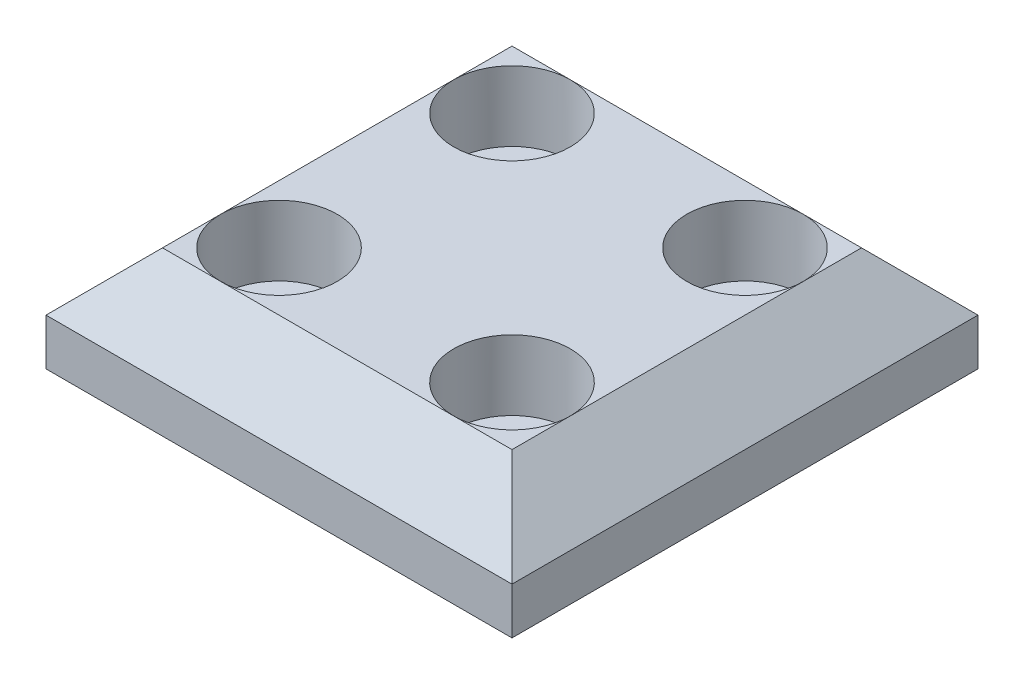
ISO-10303-21;
HEADER;
FILE_DESCRIPTION(('STEP AP214'),'2;1');
FILE_NAME('part.step','',(''),(''),'','','');
FILE_SCHEMA(('AUTOMOTIVE_DESIGN { 1 0 10303 214 1 1 1 1 }'));
ENDSEC;
DATA;
#1=APPLICATION_CONTEXT('core data for automotive mechanical design processes');
#2=APPLICATION_PROTOCOL_DEFINITION('international standard','automotive_design',2000,#1);
#3=PRODUCT_CONTEXT('',#1,'mechanical');
#4=PRODUCT('Part','Part','',(#3));
#5=PRODUCT_RELATED_PRODUCT_CATEGORY('part','',(#4));
#6=PRODUCT_DEFINITION_FORMATION('','',#4);
#7=PRODUCT_DEFINITION_CONTEXT('part definition',#1,'design');
#8=PRODUCT_DEFINITION('design','',#6,#7);
#9=PRODUCT_DEFINITION_SHAPE('','',#8);
#10=(LENGTH_UNIT() NAMED_UNIT(*) SI_UNIT(.MILLI.,.METRE.));
#11=(NAMED_UNIT(*) PLANE_ANGLE_UNIT() SI_UNIT($,.RADIAN.));
#12=(NAMED_UNIT(*) SI_UNIT($,.STERADIAN.) SOLID_ANGLE_UNIT());
#13=UNCERTAINTY_MEASURE_WITH_UNIT(LENGTH_MEASURE(1.E-05),#10,'distance_accuracy_value','');
#14=(GEOMETRIC_REPRESENTATION_CONTEXT(3) GLOBAL_UNCERTAINTY_ASSIGNED_CONTEXT((#13)) GLOBAL_UNIT_ASSIGNED_CONTEXT((#10,
#11,#12)) REPRESENTATION_CONTEXT('',''));
#15=CARTESIAN_POINT('',(0.,0.,0.));
#16=DIRECTION('',(0.,0.,1.));
#17=DIRECTION('',(1.,0.,0.));
#18=AXIS2_PLACEMENT_3D('',#15,#16,#17);
#19=CARTESIAN_POINT('',(0.,9.,0.));
#20=DIRECTION('',(0.,-1.,0.));
#21=DIRECTION('',(0.,0.,-1.));
#22=AXIS2_PLACEMENT_3D('',#19,#20,#21);
#23=PLANE('',#22);
#24=CARTESIAN_POINT('',(30.,9.,-10.));
#25=DIRECTION('',(0.,1.,0.));
#26=DIRECTION('',(0.,0.,1.));
#27=AXIS2_PLACEMENT_3D('',#24,#25,#26);
#28=CIRCLE('',#27,5.);
#29=CARTESIAN_POINT('',(30.,9.,-5.00000000000001));
#30=VERTEX_POINT('',#29);
#31=CARTESIAN_POINT('',(35.,9.,-10.));
#32=VERTEX_POINT('',#31);
#33=EDGE_CURVE('E268',#30,#32,#28,.T.);
#34=ORIENTED_EDGE('',*,*,#33,.F.);
#35=DIRECTION('',(1.,0.,0.));
#36=VECTOR('',#35,1.);
#37=CARTESIAN_POINT('',(0.,9.,-5.00000000000001));
#38=LINE('',#37,#36);
#39=CARTESIAN_POINT('',(35.,9.,-5.00000000000001));
#40=VERTEX_POINT('',#39);
#41=EDGE_CURVE('E194',#30,#40,#38,.T.);
#42=ORIENTED_EDGE('',*,*,#41,.T.);
#43=DIRECTION('',(0.,0.,-1.));
#44=VECTOR('',#43,1.);
#45=CARTESIAN_POINT('',(35.,9.,0.));
#46=LINE('',#45,#44);
#47=EDGE_CURVE('E192',#40,#32,#46,.T.);
#48=ORIENTED_EDGE('',*,*,#47,.T.);
#49=EDGE_LOOP('',(#34,#42,#48));
#50=FACE_BOUND('',#49,.T.);
#51=ADVANCED_FACE('F43',(#50),#23,.F.);
#52=EDGE_CURVE('E267',#32,#30,#28,.T.);
#53=ORIENTED_EDGE('',*,*,#52,.F.);
#54=DIRECTION('',(0.,0.,-1.));
#55=VECTOR('',#54,1.);
#56=CARTESIAN_POINT('',(35.,9.,0.));
#57=LINE('',#56,#55);
#58=CARTESIAN_POINT('',(35.,9.,-30.));
#59=VERTEX_POINT('',#58);
#60=EDGE_CURVE('E190',#32,#59,#57,.T.);
#61=ORIENTED_EDGE('',*,*,#60,.T.);
#62=CARTESIAN_POINT('',(30.,9.,-30.));
#63=DIRECTION('',(0.,1.,0.));
#64=DIRECTION('',(0.,0.,1.));
#65=AXIS2_PLACEMENT_3D('',#62,#63,#64);
#66=CIRCLE('',#65,5.);
#67=CARTESIAN_POINT('',(30.,9.,-35.));
#68=VERTEX_POINT('',#67);
#69=EDGE_CURVE('E257',#68,#59,#66,.T.);
#70=ORIENTED_EDGE('',*,*,#69,.F.);
#71=DIRECTION('',(-1.,0.,0.));
#72=VECTOR('',#71,1.);
#73=CARTESIAN_POINT('',(0.,9.,-35.));
#74=LINE('',#73,#72);
#75=CARTESIAN_POINT('',(10.,9.,-35.));
#76=VERTEX_POINT('',#75);
#77=EDGE_CURVE('E181',#68,#76,#74,.T.);
#78=ORIENTED_EDGE('',*,*,#77,.T.);
#79=CARTESIAN_POINT('',(10.,9.,-30.));
#80=DIRECTION('',(0.,1.,0.));
#81=DIRECTION('',(0.,0.,1.));
#82=AXIS2_PLACEMENT_3D('',#79,#80,#81);
#83=CIRCLE('',#82,5.);
#84=CARTESIAN_POINT('',(5.00000000000001,9.,-30.));
#85=VERTEX_POINT('',#84);
#86=EDGE_CURVE('E216',#85,#76,#83,.T.);
#87=ORIENTED_EDGE('',*,*,#86,.F.);
#88=DIRECTION('',(0.,0.,1.));
#89=VECTOR('',#88,1.);
#90=CARTESIAN_POINT('',(5.00000000000001,9.,0.));
#91=LINE('',#90,#89);
#92=CARTESIAN_POINT('',(5.00000000000001,9.,-10.));
#93=VERTEX_POINT('',#92);
#94=EDGE_CURVE('E173',#85,#93,#91,.T.);
#95=ORIENTED_EDGE('',*,*,#94,.T.);
#96=CARTESIAN_POINT('',(10.,9.,-10.));
#97=DIRECTION('',(0.,1.,0.));
#98=DIRECTION('',(0.,0.,1.));
#99=AXIS2_PLACEMENT_3D('',#96,#97,#98);
#100=CIRCLE('',#99,5.);
#101=CARTESIAN_POINT('',(10.,9.,-5.00000000000001));
#102=VERTEX_POINT('',#101);
#103=EDGE_CURVE('E227',#102,#93,#100,.T.);
#104=ORIENTED_EDGE('',*,*,#103,.F.);
#105=DIRECTION('',(1.,0.,0.));
#106=VECTOR('',#105,1.);
#107=CARTESIAN_POINT('',(0.,9.,-5.00000000000001));
#108=LINE('',#107,#106);
#109=EDGE_CURVE('E186',#102,#30,#108,.T.);
#110=ORIENTED_EDGE('',*,*,#109,.T.);
#111=EDGE_LOOP('',(#53,#61,#70,#78,#87,#95,#104,#110));
#112=FACE_BOUND('',#111,.T.);
#113=ADVANCED_FACE('F287',(#112),#23,.F.);
#114=EDGE_CURVE('E259',#59,#68,#66,.T.);
#115=ORIENTED_EDGE('',*,*,#114,.F.);
#116=DIRECTION('',(0.,0.,-1.));
#117=VECTOR('',#116,1.);
#118=CARTESIAN_POINT('',(35.,9.,0.));
#119=LINE('',#118,#117);
#120=CARTESIAN_POINT('',(35.,9.,-35.));
#121=VERTEX_POINT('',#120);
#122=EDGE_CURVE('E188',#59,#121,#119,.T.);
#123=ORIENTED_EDGE('',*,*,#122,.T.);
#124=DIRECTION('',(-1.,0.,0.));
#125=VECTOR('',#124,1.);
#126=CARTESIAN_POINT('',(0.,9.,-35.));
#127=LINE('',#126,#125);
#128=EDGE_CURVE('E183',#121,#68,#127,.T.);
#129=ORIENTED_EDGE('',*,*,#128,.T.);
#130=EDGE_LOOP('',(#115,#123,#129));
#131=FACE_BOUND('',#130,.T.);
#132=ADVANCED_FACE('F291',(#131),#23,.F.);
#133=EDGE_CURVE('E221',#76,#85,#83,.T.);
#134=ORIENTED_EDGE('',*,*,#133,.F.);
#135=DIRECTION('',(-1.,0.,0.));
#136=VECTOR('',#135,1.);
#137=CARTESIAN_POINT('',(0.,9.,-35.));
#138=LINE('',#137,#136);
#139=CARTESIAN_POINT('',(5.00000000000001,9.,-35.));
#140=VERTEX_POINT('',#139);
#141=EDGE_CURVE('E179',#76,#140,#138,.T.);
#142=ORIENTED_EDGE('',*,*,#141,.T.);
#143=DIRECTION('',(0.,0.,1.));
#144=VECTOR('',#143,1.);
#145=CARTESIAN_POINT('',(5.00000000000001,9.,0.));
#146=LINE('',#145,#144);
#147=EDGE_CURVE('E175',#140,#85,#146,.T.);
#148=ORIENTED_EDGE('',*,*,#147,.T.);
#149=EDGE_LOOP('',(#134,#142,#148));
#150=FACE_BOUND('',#149,.T.);
#151=ADVANCED_FACE('F302',(#150),#23,.F.);
#152=CARTESIAN_POINT('',(10.,9.,-30.));
#153=DIRECTION('',(0.,-1.,0.));
#154=DIRECTION('',(0.,0.,-1.));
#155=AXIS2_PLACEMENT_3D('',#152,#153,#154);
#156=CYLINDRICAL_SURFACE('',#155,2.75);
#157=CARTESIAN_POINT('',(10.,0.,-30.));
#158=DIRECTION('',(0.,1.,0.));
#159=DIRECTION('',(0.,0.,1.));
#160=AXIS2_PLACEMENT_3D('',#157,#158,#159);
#161=CIRCLE('',#160,2.75);
#162=CARTESIAN_POINT('',(10.,0.,-27.25));
#163=VERTEX_POINT('',#162);
#164=EDGE_CURVE('E144',#163,#163,#161,.T.);
#165=ORIENTED_EDGE('',*,*,#164,.F.);
#166=EDGE_LOOP('',(#165));
#167=FACE_BOUND('',#166,.T.);
#168=CARTESIAN_POINT('',(10.,3.,-30.));
#169=DIRECTION('',(0.,1.,0.));
#170=DIRECTION('',(0.,0.,1.));
#171=AXIS2_PLACEMENT_3D('',#168,#169,#170);
#172=CIRCLE('',#171,2.75);
#173=CARTESIAN_POINT('',(10.,3.,-27.25));
#174=VERTEX_POINT('',#173);
#175=EDGE_CURVE('E168',#174,#174,#172,.T.);
#176=ORIENTED_EDGE('',*,*,#175,.T.);
#177=EDGE_LOOP('',(#176));
#178=FACE_BOUND('',#177,.T.);
#179=ADVANCED_FACE('F243',(#167,#178),#156,.F.);
#180=CARTESIAN_POINT('',(30.,9.,-30.));
#181=DIRECTION('',(0.,-1.,0.));
#182=DIRECTION('',(0.,0.,-1.));
#183=AXIS2_PLACEMENT_3D('',#180,#181,#182);
#184=CYLINDRICAL_SURFACE('',#183,2.75);
#185=CARTESIAN_POINT('',(30.,0.,-30.));
#186=DIRECTION('',(0.,1.,0.));
#187=DIRECTION('',(0.,0.,1.));
#188=AXIS2_PLACEMENT_3D('',#185,#186,#187);
#189=CIRCLE('',#188,2.75);
#190=CARTESIAN_POINT('',(30.,0.,-27.25));
#191=VERTEX_POINT('',#190);
#192=EDGE_CURVE('E147',#191,#191,#189,.T.);
#193=ORIENTED_EDGE('',*,*,#192,.F.);
#194=EDGE_LOOP('',(#193));
#195=FACE_BOUND('',#194,.T.);
#196=CARTESIAN_POINT('',(30.,3.,-30.));
#197=DIRECTION('',(0.,1.,0.));
#198=DIRECTION('',(0.,0.,1.));
#199=AXIS2_PLACEMENT_3D('',#196,#197,#198);
#200=CIRCLE('',#199,2.75);
#201=CARTESIAN_POINT('',(30.,3.,-27.25));
#202=VERTEX_POINT('',#201);
#203=EDGE_CURVE('E165',#202,#202,#200,.T.);
#204=ORIENTED_EDGE('',*,*,#203,.T.);
#205=EDGE_LOOP('',(#204));
#206=FACE_BOUND('',#205,.T.);
#207=ADVANCED_FACE('F239',(#195,#206),#184,.F.);
#208=CARTESIAN_POINT('',(30.,9.,-10.));
#209=DIRECTION('',(0.,-1.,0.));
#210=DIRECTION('',(0.,0.,-1.));
#211=AXIS2_PLACEMENT_3D('',#208,#209,#210);
#212=CYLINDRICAL_SURFACE('',#211,2.75);
#213=CARTESIAN_POINT('',(30.,0.,-10.));
#214=DIRECTION('',(0.,1.,0.));
#215=DIRECTION('',(0.,0.,1.));
#216=AXIS2_PLACEMENT_3D('',#213,#214,#215);
#217=CIRCLE('',#216,2.75);
#218=CARTESIAN_POINT('',(30.,0.,-7.25));
#219=VERTEX_POINT('',#218);
#220=EDGE_CURVE('E233',#219,#219,#217,.T.);
#221=ORIENTED_EDGE('',*,*,#220,.F.);
#222=EDGE_LOOP('',(#221));
#223=FACE_BOUND('',#222,.T.);
#224=CARTESIAN_POINT('',(30.,3.,-10.));
#225=DIRECTION('',(0.,1.,0.));
#226=DIRECTION('',(0.,0.,1.));
#227=AXIS2_PLACEMENT_3D('',#224,#225,#226);
#228=CIRCLE('',#227,2.75);
#229=CARTESIAN_POINT('',(30.,3.,-7.25));
#230=VERTEX_POINT('',#229);
#231=EDGE_CURVE('E161',#230,#230,#228,.T.);
#232=ORIENTED_EDGE('',*,*,#231,.T.);
#233=EDGE_LOOP('',(#232));
#234=FACE_BOUND('',#233,.T.);
#235=ADVANCED_FACE('F242',(#223,#234),#212,.F.);
#236=CARTESIAN_POINT('',(10.,9.,-10.));
#237=DIRECTION('',(0.,-1.,0.));
#238=DIRECTION('',(0.,0.,-1.));
#239=AXIS2_PLACEMENT_3D('',#236,#237,#238);
#240=CYLINDRICAL_SURFACE('',#239,2.75);
#241=CARTESIAN_POINT('',(10.,0.,-10.));
#242=DIRECTION('',(0.,1.,0.));
#243=DIRECTION('',(0.,0.,1.));
#244=AXIS2_PLACEMENT_3D('',#241,#242,#243);
#245=CIRCLE('',#244,2.75);
#246=CARTESIAN_POINT('',(10.,0.,-7.25));
#247=VERTEX_POINT('',#246);
#248=EDGE_CURVE('E171',#247,#247,#245,.T.);
#249=ORIENTED_EDGE('',*,*,#248,.F.);
#250=EDGE_LOOP('',(#249));
#251=FACE_BOUND('',#250,.T.);
#252=CARTESIAN_POINT('',(10.,3.,-10.));
#253=DIRECTION('',(0.,1.,0.));
#254=DIRECTION('',(0.,0.,1.));
#255=AXIS2_PLACEMENT_3D('',#252,#253,#254);
#256=CIRCLE('',#255,2.75);
#257=CARTESIAN_POINT('',(10.,3.,-7.25));
#258=VERTEX_POINT('',#257);
#259=EDGE_CURVE('E158',#258,#258,#256,.T.);
#260=ORIENTED_EDGE('',*,*,#259,.T.);
#261=EDGE_LOOP('',(#260));
#262=FACE_BOUND('',#261,.T.);
#263=ADVANCED_FACE('F328',(#251,#262),#240,.F.);
#264=DIRECTION('',(0.,0.,1.));
#265=VECTOR('',#264,1.);
#266=CARTESIAN_POINT('',(5.00000000000001,9.,0.));
#267=LINE('',#266,#265);
#268=CARTESIAN_POINT('',(5.00000000000001,9.,-5.00000000000001));
#269=VERTEX_POINT('',#268);
#270=EDGE_CURVE('E128',#93,#269,#267,.T.);
#271=ORIENTED_EDGE('',*,*,#270,.T.);
#272=DIRECTION('',(1.,0.,0.));
#273=VECTOR('',#272,1.);
#274=CARTESIAN_POINT('',(0.,9.,-5.00000000000001));
#275=LINE('',#274,#273);
#276=EDGE_CURVE('E177',#269,#102,#275,.T.);
#277=ORIENTED_EDGE('',*,*,#276,.T.);
#278=EDGE_CURVE('E230',#93,#102,#100,.T.);
#279=ORIENTED_EDGE('',*,*,#278,.F.);
#280=EDGE_LOOP('',(#271,#277,#279));
#281=FACE_BOUND('',#280,.T.);
#282=ADVANCED_FACE('F320',(#281),#23,.F.);
#283=CARTESIAN_POINT('',(0.,0.,0.));
#284=DIRECTION('',(0.,-1.,0.));
#285=DIRECTION('',(0.,0.,-1.));
#286=AXIS2_PLACEMENT_3D('',#283,#284,#285);
#287=PLANE('',#286);
#288=ORIENTED_EDGE('',*,*,#220,.T.);
#289=EDGE_LOOP('',(#288));
#290=FACE_BOUND('',#289,.T.);
#291=ORIENTED_EDGE('',*,*,#164,.T.);
#292=EDGE_LOOP('',(#291));
#293=FACE_BOUND('',#292,.T.);
#294=DIRECTION('',(0.,0.,1.));
#295=VECTOR('',#294,1.);
#296=CARTESIAN_POINT('',(0.,0.,0.));
#297=LINE('',#296,#295);
#298=CARTESIAN_POINT('',(0.,0.,-40.));
#299=VERTEX_POINT('',#298);
#300=CARTESIAN_POINT('',(0.,0.,0.));
#301=VERTEX_POINT('',#300);
#302=EDGE_CURVE('E136',#299,#301,#297,.T.);
#303=ORIENTED_EDGE('',*,*,#302,.F.);
#304=DIRECTION('',(-1.,0.,0.));
#305=VECTOR('',#304,1.);
#306=CARTESIAN_POINT('',(0.,0.,-40.));
#307=LINE('',#306,#305);
#308=CARTESIAN_POINT('',(40.,0.,-40.));
#309=VERTEX_POINT('',#308);
#310=EDGE_CURVE('E152',#309,#299,#307,.T.);
#311=ORIENTED_EDGE('',*,*,#310,.F.);
#312=DIRECTION('',(0.,0.,-1.));
#313=VECTOR('',#312,1.);
#314=CARTESIAN_POINT('',(40.,0.,0.));
#315=LINE('',#314,#313);
#316=CARTESIAN_POINT('',(40.,0.,0.));
#317=VERTEX_POINT('',#316);
#318=EDGE_CURVE('E138',#317,#309,#315,.T.);
#319=ORIENTED_EDGE('',*,*,#318,.F.);
#320=DIRECTION('',(1.,0.,0.));
#321=VECTOR('',#320,1.);
#322=CARTESIAN_POINT('',(0.,0.,0.));
#323=LINE('',#322,#321);
#324=EDGE_CURVE('E123',#301,#317,#323,.T.);
#325=ORIENTED_EDGE('',*,*,#324,.F.);
#326=EDGE_LOOP('',(#303,#311,#319,#325));
#327=FACE_BOUND('',#326,.T.);
#328=ORIENTED_EDGE('',*,*,#192,.T.);
#329=EDGE_LOOP('',(#328));
#330=FACE_BOUND('',#329,.T.);
#331=ORIENTED_EDGE('',*,*,#248,.T.);
#332=EDGE_LOOP('',(#331));
#333=FACE_BOUND('',#332,.T.);
#334=ADVANCED_FACE('F133',(#290,#293,#327,#330,#333),#287,.T.);
#335=CARTESIAN_POINT('',(0.,9.,0.));
#336=DIRECTION('',(1.,0.,0.));
#337=DIRECTION('',(0.,0.,-1.));
#338=AXIS2_PLACEMENT_3D('',#335,#336,#337);
#339=PLANE('',#338);
#340=DIRECTION('',(0.,-1.,0.));
#341=VECTOR('',#340,1.);
#342=CARTESIAN_POINT('',(0.,9.,0.));
#343=LINE('',#342,#341);
#344=CARTESIAN_POINT('',(0.,3.99999999999997,0.));
#345=VERTEX_POINT('',#344);
#346=EDGE_CURVE('E120',#345,#301,#343,.T.);
#347=ORIENTED_EDGE('',*,*,#346,.F.);
#348=DIRECTION('',(0.,0.,-1.));
#349=VECTOR('',#348,1.);
#350=CARTESIAN_POINT('',(0.,3.99999999999997,0.));
#351=LINE('',#350,#349);
#352=CARTESIAN_POINT('',(0.,3.99999999999997,-40.));
#353=VERTEX_POINT('',#352);
#354=EDGE_CURVE('E11',#345,#353,#351,.T.);
#355=ORIENTED_EDGE('',*,*,#354,.T.);
#356=DIRECTION('',(0.,-1.,0.));
#357=VECTOR('',#356,1.);
#358=CARTESIAN_POINT('',(0.,9.,-40.));
#359=LINE('',#358,#357);
#360=EDGE_CURVE('E142',#353,#299,#359,.T.);
#361=ORIENTED_EDGE('',*,*,#360,.T.);
#362=ORIENTED_EDGE('',*,*,#302,.T.);
#363=EDGE_LOOP('',(#347,#355,#361,#362));
#364=FACE_BOUND('',#363,.T.);
#365=ADVANCED_FACE('F140',(#364),#339,.F.);
#366=CARTESIAN_POINT('',(0.,9.,0.));
#367=DIRECTION('',(0.,0.,-1.));
#368=DIRECTION('',(-1.,0.,0.));
#369=AXIS2_PLACEMENT_3D('',#366,#367,#368);
#370=PLANE('',#369);
#371=DIRECTION('',(0.,-1.,0.));
#372=VECTOR('',#371,1.);
#373=CARTESIAN_POINT('',(40.,9.,0.));
#374=LINE('',#373,#372);
#375=CARTESIAN_POINT('',(40.,3.99999999999997,0.));
#376=VERTEX_POINT('',#375);
#377=EDGE_CURVE('E129',#376,#317,#374,.T.);
#378=ORIENTED_EDGE('',*,*,#377,.F.);
#379=DIRECTION('',(-1.,0.,0.));
#380=VECTOR('',#379,1.);
#381=CARTESIAN_POINT('',(0.,3.99999999999997,0.));
#382=LINE('',#381,#380);
#383=EDGE_CURVE('E53',#376,#345,#382,.T.);
#384=ORIENTED_EDGE('',*,*,#383,.T.);
#385=ORIENTED_EDGE('',*,*,#346,.T.);
#386=ORIENTED_EDGE('',*,*,#324,.T.);
#387=EDGE_LOOP('',(#378,#384,#385,#386));
#388=FACE_BOUND('',#387,.T.);
#389=ADVANCED_FACE('F122',(#388),#370,.F.);
#390=CARTESIAN_POINT('',(40.,9.,0.));
#391=DIRECTION('',(-1.,0.,0.));
#392=DIRECTION('',(0.,0.,1.));
#393=AXIS2_PLACEMENT_3D('',#390,#391,#392);
#394=PLANE('',#393);
#395=DIRECTION('',(0.,-1.,0.));
#396=VECTOR('',#395,1.);
#397=CARTESIAN_POINT('',(40.,9.,-40.));
#398=LINE('',#397,#396);
#399=CARTESIAN_POINT('',(40.,3.99999999999997,-40.));
#400=VERTEX_POINT('',#399);
#401=EDGE_CURVE('E155',#400,#309,#398,.T.);
#402=ORIENTED_EDGE('',*,*,#401,.F.);
#403=DIRECTION('',(0.,0.,1.));
#404=VECTOR('',#403,1.);
#405=CARTESIAN_POINT('',(40.,3.99999999999997,0.));
#406=LINE('',#405,#404);
#407=EDGE_CURVE('E68',#400,#376,#406,.T.);
#408=ORIENTED_EDGE('',*,*,#407,.T.);
#409=ORIENTED_EDGE('',*,*,#377,.T.);
#410=ORIENTED_EDGE('',*,*,#318,.T.);
#411=EDGE_LOOP('',(#402,#408,#409,#410));
#412=FACE_BOUND('',#411,.T.);
#413=ADVANCED_FACE('F308',(#412),#394,.F.);
#414=CARTESIAN_POINT('',(0.,9.,-40.));
#415=DIRECTION('',(0.,0.,1.));
#416=DIRECTION('',(1.,0.,0.));
#417=AXIS2_PLACEMENT_3D('',#414,#415,#416);
#418=PLANE('',#417);
#419=ORIENTED_EDGE('',*,*,#360,.F.);
#420=DIRECTION('',(1.,0.,0.));
#421=VECTOR('',#420,1.);
#422=CARTESIAN_POINT('',(0.,3.99999999999997,-40.));
#423=LINE('',#422,#421);
#424=EDGE_CURVE('E196',#353,#400,#423,.T.);
#425=ORIENTED_EDGE('',*,*,#424,.T.);
#426=ORIENTED_EDGE('',*,*,#401,.T.);
#427=ORIENTED_EDGE('',*,*,#310,.T.);
#428=EDGE_LOOP('',(#419,#425,#426,#427));
#429=FACE_BOUND('',#428,.T.);
#430=ADVANCED_FACE('F307',(#429),#418,.F.);
#431=CARTESIAN_POINT('',(10.,3.,-10.));
#432=DIRECTION('',(0.,1.,0.));
#433=DIRECTION('',(0.,0.,1.));
#434=AXIS2_PLACEMENT_3D('',#431,#432,#433);
#435=CYLINDRICAL_SURFACE('',#434,5.);
#436=CARTESIAN_POINT('',(10.,3.,-10.));
#437=DIRECTION('',(0.,1.,0.));
#438=DIRECTION('',(0.,0.,1.));
#439=AXIS2_PLACEMENT_3D('',#436,#437,#438);
#440=CIRCLE('',#439,5.);
#441=CARTESIAN_POINT('',(10.,3.,-5.));
#442=VERTEX_POINT('',#441);
#443=EDGE_CURVE('E162',#442,#442,#440,.T.);
#444=ORIENTED_EDGE('',*,*,#443,.F.);
#445=EDGE_LOOP('',(#444));
#446=FACE_BOUND('',#445,.T.);
#447=ORIENTED_EDGE('',*,*,#103,.T.);
#448=ORIENTED_EDGE('',*,*,#278,.T.);
#449=EDGE_LOOP('',(#447,#448));
#450=FACE_BOUND('',#449,.T.);
#451=ADVANCED_FACE('F315',(#446,#450),#435,.F.);
#452=CARTESIAN_POINT('',(10.,3.,-10.));
#453=DIRECTION('',(0.,1.,0.));
#454=DIRECTION('',(0.,0.,1.));
#455=AXIS2_PLACEMENT_3D('',#452,#453,#454);
#456=PLANE('',#455);
#457=ORIENTED_EDGE('',*,*,#259,.F.);
#458=EDGE_LOOP('',(#457));
#459=FACE_BOUND('',#458,.T.);
#460=ORIENTED_EDGE('',*,*,#443,.T.);
#461=EDGE_LOOP('',(#460));
#462=FACE_BOUND('',#461,.T.);
#463=ADVANCED_FACE('F415',(#459,#462),#456,.T.);
#464=CARTESIAN_POINT('',(30.,3.,-10.));
#465=DIRECTION('',(0.,1.,0.));
#466=DIRECTION('',(0.,0.,1.));
#467=AXIS2_PLACEMENT_3D('',#464,#465,#466);
#468=CYLINDRICAL_SURFACE('',#467,5.);
#469=CARTESIAN_POINT('',(30.,3.,-10.));
#470=DIRECTION('',(0.,1.,0.));
#471=DIRECTION('',(0.,0.,1.));
#472=AXIS2_PLACEMENT_3D('',#469,#470,#471);
#473=CIRCLE('',#472,5.);
#474=CARTESIAN_POINT('',(30.,3.,-5.));
#475=VERTEX_POINT('',#474);
#476=EDGE_CURVE('E264',#475,#475,#473,.T.);
#477=ORIENTED_EDGE('',*,*,#476,.F.);
#478=EDGE_LOOP('',(#477));
#479=FACE_BOUND('',#478,.T.);
#480=ORIENTED_EDGE('',*,*,#33,.T.);
#481=ORIENTED_EDGE('',*,*,#52,.T.);
#482=EDGE_LOOP('',(#480,#481));
#483=FACE_BOUND('',#482,.T.);
#484=ADVANCED_FACE('F276',(#479,#483),#468,.F.);
#485=CARTESIAN_POINT('',(30.,3.,-10.));
#486=DIRECTION('',(0.,1.,0.));
#487=DIRECTION('',(0.,0.,1.));
#488=AXIS2_PLACEMENT_3D('',#485,#486,#487);
#489=PLANE('',#488);
#490=ORIENTED_EDGE('',*,*,#231,.F.);
#491=EDGE_LOOP('',(#490));
#492=FACE_BOUND('',#491,.T.);
#493=ORIENTED_EDGE('',*,*,#476,.T.);
#494=EDGE_LOOP('',(#493));
#495=FACE_BOUND('',#494,.T.);
#496=ADVANCED_FACE('F406',(#492,#495),#489,.T.);
#497=CARTESIAN_POINT('',(30.,3.,-30.));
#498=DIRECTION('',(0.,1.,0.));
#499=DIRECTION('',(0.,0.,1.));
#500=AXIS2_PLACEMENT_3D('',#497,#498,#499);
#501=CYLINDRICAL_SURFACE('',#500,5.);
#502=CARTESIAN_POINT('',(30.,3.,-30.));
#503=DIRECTION('',(0.,1.,0.));
#504=DIRECTION('',(0.,0.,1.));
#505=AXIS2_PLACEMENT_3D('',#502,#503,#504);
#506=CIRCLE('',#505,5.);
#507=CARTESIAN_POINT('',(30.,3.,-25.));
#508=VERTEX_POINT('',#507);
#509=EDGE_CURVE('E255',#508,#508,#506,.T.);
#510=ORIENTED_EDGE('',*,*,#509,.F.);
#511=EDGE_LOOP('',(#510));
#512=FACE_BOUND('',#511,.T.);
#513=ORIENTED_EDGE('',*,*,#114,.T.);
#514=ORIENTED_EDGE('',*,*,#69,.T.);
#515=EDGE_LOOP('',(#513,#514));
#516=FACE_BOUND('',#515,.T.);
#517=ADVANCED_FACE('F251',(#512,#516),#501,.F.);
#518=CARTESIAN_POINT('',(30.,3.,-30.));
#519=DIRECTION('',(0.,1.,0.));
#520=DIRECTION('',(0.,0.,1.));
#521=AXIS2_PLACEMENT_3D('',#518,#519,#520);
#522=PLANE('',#521);
#523=ORIENTED_EDGE('',*,*,#203,.F.);
#524=EDGE_LOOP('',(#523));
#525=FACE_BOUND('',#524,.T.);
#526=ORIENTED_EDGE('',*,*,#509,.T.);
#527=EDGE_LOOP('',(#526));
#528=FACE_BOUND('',#527,.T.);
#529=ADVANCED_FACE('F247',(#525,#528),#522,.T.);
#530=CARTESIAN_POINT('',(10.,3.,-30.));
#531=DIRECTION('',(0.,1.,0.));
#532=DIRECTION('',(0.,0.,1.));
#533=AXIS2_PLACEMENT_3D('',#530,#531,#532);
#534=CYLINDRICAL_SURFACE('',#533,5.);
#535=CARTESIAN_POINT('',(10.,3.,-30.));
#536=DIRECTION('',(0.,1.,0.));
#537=DIRECTION('',(0.,0.,1.));
#538=AXIS2_PLACEMENT_3D('',#535,#536,#537);
#539=CIRCLE('',#538,5.);
#540=CARTESIAN_POINT('',(10.,3.,-25.));
#541=VERTEX_POINT('',#540);
#542=EDGE_CURVE('E211',#541,#541,#539,.T.);
#543=ORIENTED_EDGE('',*,*,#542,.F.);
#544=EDGE_LOOP('',(#543));
#545=FACE_BOUND('',#544,.T.);
#546=ORIENTED_EDGE('',*,*,#133,.T.);
#547=ORIENTED_EDGE('',*,*,#86,.T.);
#548=EDGE_LOOP('',(#546,#547));
#549=FACE_BOUND('',#548,.T.);
#550=ADVANCED_FACE('F250',(#545,#549),#534,.F.);
#551=CARTESIAN_POINT('',(10.,3.,-30.));
#552=DIRECTION('',(0.,1.,0.));
#553=DIRECTION('',(0.,0.,1.));
#554=AXIS2_PLACEMENT_3D('',#551,#552,#553);
#555=PLANE('',#554);
#556=ORIENTED_EDGE('',*,*,#175,.F.);
#557=EDGE_LOOP('',(#556));
#558=FACE_BOUND('',#557,.T.);
#559=ORIENTED_EDGE('',*,*,#542,.T.);
#560=EDGE_LOOP('',(#559));
#561=FACE_BOUND('',#560,.T.);
#562=ADVANCED_FACE('F366',(#558,#561),#555,.T.);
#563=CARTESIAN_POINT('',(0.,9.,-5.00000000000001));
#564=DIRECTION('',(0.,-0.707106781186547,-0.707106781186549));
#565=DIRECTION('',(1.,0.,0.));
#566=AXIS2_PLACEMENT_3D('',#563,#564,#565);
#567=PLANE('',#566);
#568=DIRECTION('',(0.577350269189625,0.577350269189627,-0.577350269189625));
#569=VECTOR('',#568,1.);
#570=CARTESIAN_POINT('',(3.33333333333334,7.33333333333333,-3.33333333333334));
#571=LINE('',#570,#569);
#572=EDGE_CURVE('E205',#345,#269,#571,.T.);
#573=ORIENTED_EDGE('',*,*,#572,.F.);
#574=ORIENTED_EDGE('',*,*,#383,.F.);
#575=DIRECTION('',(-0.577350269189625,0.577350269189627,-0.577350269189625));
#576=VECTOR('',#575,1.);
#577=CARTESIAN_POINT('',(23.3333333333333,20.6666666666667,-16.6666666666667));
#578=LINE('',#577,#576);
#579=EDGE_CURVE('E48',#40,#376,#578,.F.);
#580=ORIENTED_EDGE('',*,*,#579,.F.);
#581=ORIENTED_EDGE('',*,*,#41,.F.);
#582=ORIENTED_EDGE('',*,*,#109,.F.);
#583=ORIENTED_EDGE('',*,*,#276,.F.);
#584=EDGE_LOOP('',(#573,#574,#580,#581,#582,#583));
#585=FACE_BOUND('',#584,.T.);
#586=ADVANCED_FACE('F46',(#585),#567,.F.);
#587=CARTESIAN_POINT('',(35.,9.,0.));
#588=DIRECTION('',(-0.707106781186549,-0.707106781186547,0.));
#589=DIRECTION('',(0.,0.,-1.));
#590=AXIS2_PLACEMENT_3D('',#587,#588,#589);
#591=PLANE('',#590);
#592=ORIENTED_EDGE('',*,*,#579,.T.);
#593=ORIENTED_EDGE('',*,*,#407,.F.);
#594=DIRECTION('',(-0.577350269189625,0.577350269189627,0.577350269189625));
#595=VECTOR('',#594,1.);
#596=CARTESIAN_POINT('',(23.3333333333333,20.6666666666667,-23.3333333333333));
#597=LINE('',#596,#595);
#598=EDGE_CURVE('E204',#121,#400,#597,.F.);
#599=ORIENTED_EDGE('',*,*,#598,.F.);
#600=ORIENTED_EDGE('',*,*,#122,.F.);
#601=ORIENTED_EDGE('',*,*,#60,.F.);
#602=ORIENTED_EDGE('',*,*,#47,.F.);
#603=EDGE_LOOP('',(#592,#593,#599,#600,#601,#602));
#604=FACE_BOUND('',#603,.T.);
#605=ADVANCED_FACE('F283',(#604),#591,.F.);
#606=CARTESIAN_POINT('',(5.00000000000001,9.,0.));
#607=DIRECTION('',(0.707106781186549,-0.707106781186547,0.));
#608=DIRECTION('',(0.,0.,1.));
#609=AXIS2_PLACEMENT_3D('',#606,#607,#608);
#610=PLANE('',#609);
#611=ORIENTED_EDGE('',*,*,#94,.F.);
#612=ORIENTED_EDGE('',*,*,#147,.F.);
#613=DIRECTION('',(-0.577350269189625,-0.577350269189627,-0.577350269189625));
#614=VECTOR('',#613,1.);
#615=CARTESIAN_POINT('',(16.6666666666667,20.6666666666667,-23.3333333333333));
#616=LINE('',#615,#614);
#617=EDGE_CURVE('E201',#353,#140,#616,.F.);
#618=ORIENTED_EDGE('',*,*,#617,.F.);
#619=ORIENTED_EDGE('',*,*,#354,.F.);
#620=ORIENTED_EDGE('',*,*,#572,.T.);
#621=ORIENTED_EDGE('',*,*,#270,.F.);
#622=EDGE_LOOP('',(#611,#612,#618,#619,#620,#621));
#623=FACE_BOUND('',#622,.T.);
#624=ADVANCED_FACE('F305',(#623),#610,.F.);
#625=CARTESIAN_POINT('',(0.,9.,-35.));
#626=DIRECTION('',(0.,-0.707106781186547,0.707106781186549));
#627=DIRECTION('',(-1.,0.,0.));
#628=AXIS2_PLACEMENT_3D('',#625,#626,#627);
#629=PLANE('',#628);
#630=ORIENTED_EDGE('',*,*,#598,.T.);
#631=ORIENTED_EDGE('',*,*,#424,.F.);
#632=ORIENTED_EDGE('',*,*,#617,.T.);
#633=ORIENTED_EDGE('',*,*,#141,.F.);
#634=ORIENTED_EDGE('',*,*,#77,.F.);
#635=ORIENTED_EDGE('',*,*,#128,.F.);
#636=EDGE_LOOP('',(#630,#631,#632,#633,#634,#635));
#637=FACE_BOUND('',#636,.T.);
#638=ADVANCED_FACE('F294',(#637),#629,.F.);
#639=CLOSED_SHELL('',(#51,#113,#132,#151,#179,#207,#235,#263,#282,#334,#365,#389,#413,#430,#451,
#463,#484,#496,#517,#529,#550,#562,#586,#605,#624,#638));
#640=MANIFOLD_SOLID_BREP('B2',#639);
#641=ADVANCED_BREP_SHAPE_REPRESENTATION('',(#18,#640),#14);
#642=SHAPE_DEFINITION_REPRESENTATION(#9,#641);
ENDSEC;
END-ISO-10303-21;
